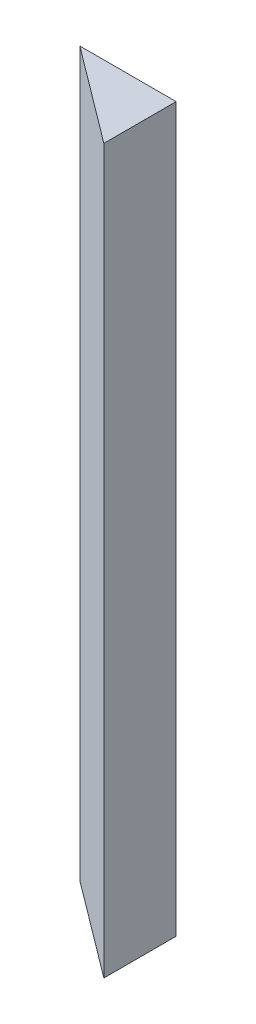
ISO-10303-21;
HEADER;
FILE_DESCRIPTION(('STEP AP214'),'2;1');
FILE_NAME('part.step','',(''),(''),'','','');
FILE_SCHEMA(('AUTOMOTIVE_DESIGN { 1 0 10303 214 1 1 1 1 }'));
ENDSEC;
DATA;
#1=APPLICATION_CONTEXT('core data for automotive mechanical design processes');
#2=APPLICATION_PROTOCOL_DEFINITION('international standard','automotive_design',2000,#1);
#3=PRODUCT_CONTEXT('',#1,'mechanical');
#4=PRODUCT('Part','Part','',(#3));
#5=PRODUCT_RELATED_PRODUCT_CATEGORY('part','',(#4));
#6=PRODUCT_DEFINITION_FORMATION('','',#4);
#7=PRODUCT_DEFINITION_CONTEXT('part definition',#1,'design');
#8=PRODUCT_DEFINITION('design','',#6,#7);
#9=PRODUCT_DEFINITION_SHAPE('','',#8);
#10=(LENGTH_UNIT() NAMED_UNIT(*) SI_UNIT(.MILLI.,.METRE.));
#11=(NAMED_UNIT(*) PLANE_ANGLE_UNIT() SI_UNIT($,.RADIAN.));
#12=(NAMED_UNIT(*) SI_UNIT($,.STERADIAN.) SOLID_ANGLE_UNIT());
#13=UNCERTAINTY_MEASURE_WITH_UNIT(LENGTH_MEASURE(1.E-05),#10,'distance_accuracy_value','');
#14=(GEOMETRIC_REPRESENTATION_CONTEXT(3) GLOBAL_UNCERTAINTY_ASSIGNED_CONTEXT((#13)) GLOBAL_UNIT_ASSIGNED_CONTEXT((#10,
#11,#12)) REPRESENTATION_CONTEXT('',''));
#15=CARTESIAN_POINT('',(0.,0.,0.));
#16=DIRECTION('',(0.,0.,1.));
#17=DIRECTION('',(1.,0.,0.));
#18=AXIS2_PLACEMENT_3D('',#15,#16,#17);
#19=CARTESIAN_POINT('',(3.90666141471167,1.74999902028157,-2.35778247673823));
#20=DIRECTION('',(1.74845553146952E-07,1.,8.74227765734759E-08));
#21=DIRECTION('',(-1.,1.74845553146952E-07,0.));
#22=AXIS2_PLACEMENT_3D('',#19,#20,#21);
#23=PLANE('',#22);
#24=DIRECTION('',(0.79975970494902,-1.92316091550056E-07,0.600320259811227));
#25=VECTOR('',#24,1.);
#26=CARTESIAN_POINT('',(3.76677813133567,1.74999904415721,-2.35112136800623));
#27=LINE('',#26,#25);
#28=CARTESIAN_POINT('',(3.76677813133567,1.74999904415621,-2.35112136800623));
#29=VERTEX_POINT('',#28);
#30=CARTESIAN_POINT('',(3.90000030597966,1.74999901212062,-2.25112136800623));
#31=VERTEX_POINT('',#30);
#32=EDGE_CURVE('E11',#29,#31,#27,.T.);
#33=ORIENTED_EDGE('',*,*,#32,.T.);
#34=DIRECTION('',(0.,8.7422775685297E-08,-0.999999999999996));
#35=VECTOR('',#34,1.);
#36=CARTESIAN_POINT('',(3.90000030597966,1.74999901212162,-2.25112136800623));
#37=LINE('',#36,#35);
#38=CARTESIAN_POINT('',(3.90000030597967,1.7499990208629,-2.35112136800623));
#39=VERTEX_POINT('',#38);
#40=EDGE_CURVE('E49',#31,#39,#37,.T.);
#41=ORIENTED_EDGE('',*,*,#40,.T.);
#42=DIRECTION('',(-0.999999999999985,1.74845553322983E-07,0.));
#43=VECTOR('',#42,1.);
#44=CARTESIAN_POINT('',(3.90000030597967,1.7499990208639,-2.35112136800623));
#45=LINE('',#44,#43);
#46=EDGE_CURVE('E47',#39,#29,#45,.T.);
#47=ORIENTED_EDGE('',*,*,#46,.T.);
#48=EDGE_LOOP('',(#33,#41,#47));
#49=FACE_BOUND('',#48,.T.);
#50=ADVANCED_FACE('F17',(#49),#23,.T.);
#51=CARTESIAN_POINT('',(3.90666123986611,0.74999902028157,-2.35778256416101));
#52=DIRECTION('',(1.74845553146952E-07,1.,8.74227765734759E-08));
#53=DIRECTION('',(-1.,1.74845553146952E-07,0.));
#54=AXIS2_PLACEMENT_3D('',#51,#52,#53);
#55=PLANE('',#54);
#56=DIRECTION('',(-0.999999999999985,1.74845553322983E-07,0.));
#57=VECTOR('',#56,1.);
#58=CARTESIAN_POINT('',(3.90000013113411,0.749999020863902,-2.35112145542901));
#59=LINE('',#58,#57);
#60=CARTESIAN_POINT('',(3.90000013113411,0.749999020864902,-2.35112145542901));
#61=VERTEX_POINT('',#60);
#62=CARTESIAN_POINT('',(3.76677795649011,0.749999044158207,-2.35112145542901));
#63=VERTEX_POINT('',#62);
#64=EDGE_CURVE('E24',#61,#63,#59,.T.);
#65=ORIENTED_EDGE('',*,*,#64,.F.);
#66=DIRECTION('',(0.,8.74227756852974E-08,-0.999999999999996));
#67=VECTOR('',#66,1.);
#68=CARTESIAN_POINT('',(3.90000013113411,0.749999012121625,-2.25112145542901));
#69=LINE('',#68,#67);
#70=CARTESIAN_POINT('',(3.90000013113411,0.749999012122625,-2.25112145542901));
#71=VERTEX_POINT('',#70);
#72=EDGE_CURVE('E53',#71,#61,#69,.T.);
#73=ORIENTED_EDGE('',*,*,#72,.F.);
#74=DIRECTION('',(0.799759704949019,-1.92316091550057E-07,0.600320259811229));
#75=VECTOR('',#74,1.);
#76=CARTESIAN_POINT('',(3.76677795649011,0.749999044157207,-2.35112145542901));
#77=LINE('',#76,#75);
#78=EDGE_CURVE('E68',#63,#71,#77,.T.);
#79=ORIENTED_EDGE('',*,*,#78,.F.);
#80=EDGE_LOOP('',(#65,#73,#79));
#81=FACE_BOUND('',#80,.T.);
#82=ADVANCED_FACE('F73',(#81),#55,.F.);
#83=CARTESIAN_POINT('',(3.76677813133567,1.74999904415721,-2.35112136800623));
#84=DIRECTION('',(0.600320259811247,-3.50461138937884E-08,-0.799759704949038));
#85=DIRECTION('',(0.799759704949028,-1.92316091942466E-07,0.600320259811235));
#86=AXIS2_PLACEMENT_3D('',#83,#84,#85);
#87=PLANE('',#86);
#88=DIRECTION('',(-1.74845553146948E-07,-0.999999999999981,-8.74227765734742E-08));
#89=VECTOR('',#88,1.);
#90=CARTESIAN_POINT('',(3.76677813133567,1.74999904415721,-2.35112136800623));
#91=LINE('',#90,#89);
#92=EDGE_CURVE('E59',#29,#63,#91,.T.);
#93=ORIENTED_EDGE('',*,*,#92,.T.);
#94=ORIENTED_EDGE('',*,*,#78,.T.);
#95=DIRECTION('',(-1.74845553146948E-07,-0.999999999999981,-8.74227765734742E-08));
#96=VECTOR('',#95,1.);
#97=CARTESIAN_POINT('',(3.90000030597966,1.74999901212162,-2.25112136800623));
#98=LINE('',#97,#96);
#99=EDGE_CURVE('E54',#31,#71,#98,.T.);
#100=ORIENTED_EDGE('',*,*,#99,.F.);
#101=ORIENTED_EDGE('',*,*,#32,.F.);
#102=EDGE_LOOP('',(#93,#94,#100,#101));
#103=FACE_BOUND('',#102,.T.);
#104=ADVANCED_FACE('F57',(#103),#87,.F.);
#105=CARTESIAN_POINT('',(3.90000030597966,1.74999901212162,-2.25112136800623));
#106=DIRECTION('',(-1.,1.74845553146952E-07,0.));
#107=DIRECTION('',(0.,8.74227765734759E-08,-1.));
#108=AXIS2_PLACEMENT_3D('',#105,#106,#107);
#109=PLANE('',#108);
#110=ORIENTED_EDGE('',*,*,#99,.T.);
#111=ORIENTED_EDGE('',*,*,#72,.T.);
#112=DIRECTION('',(-1.74845553146948E-07,-0.999999999999981,-8.74227765734742E-08));
#113=VECTOR('',#112,1.);
#114=CARTESIAN_POINT('',(3.90000030597967,1.7499990208639,-2.35112136800623));
#115=LINE('',#114,#113);
#116=EDGE_CURVE('E70',#39,#61,#115,.T.);
#117=ORIENTED_EDGE('',*,*,#116,.F.);
#118=ORIENTED_EDGE('',*,*,#40,.F.);
#119=EDGE_LOOP('',(#110,#111,#117,#118));
#120=FACE_BOUND('',#119,.T.);
#121=ADVANCED_FACE('F72',(#120),#109,.F.);
#122=CARTESIAN_POINT('',(3.90000030597967,1.7499990208639,-2.35112136800623));
#123=DIRECTION('',(0.,-8.74227765734759E-08,1.));
#124=DIRECTION('',(-1.,1.74845553146952E-07,0.));
#125=AXIS2_PLACEMENT_3D('',#122,#123,#124);
#126=PLANE('',#125);
#127=ORIENTED_EDGE('',*,*,#116,.T.);
#128=ORIENTED_EDGE('',*,*,#64,.T.);
#129=ORIENTED_EDGE('',*,*,#92,.F.);
#130=ORIENTED_EDGE('',*,*,#46,.F.);
#131=EDGE_LOOP('',(#127,#128,#129,#130));
#132=FACE_BOUND('',#131,.T.);
#133=ADVANCED_FACE('F61',(#132),#126,.F.);
#134=CLOSED_SHELL('',(#50,#82,#104,#121,#133));
#135=MANIFOLD_SOLID_BREP('B1',#134);
#136=ADVANCED_BREP_SHAPE_REPRESENTATION('',(#18,#135),#14);
#137=SHAPE_DEFINITION_REPRESENTATION(#9,#136);
ENDSEC;
END-ISO-10303-21;
